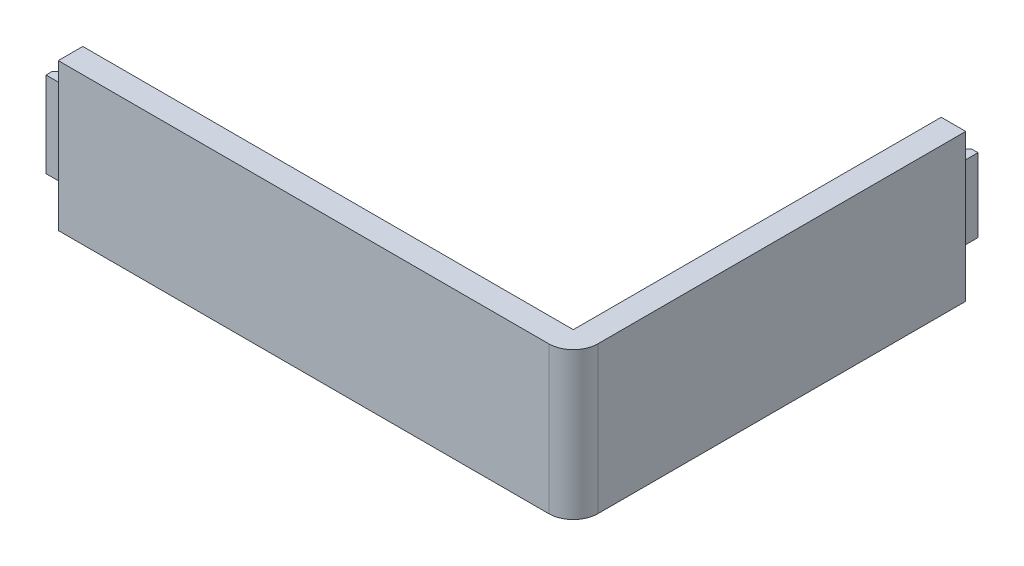
ISO-10303-21;
HEADER;
FILE_DESCRIPTION(('STEP AP214'),'2;1');
FILE_NAME('part.step','',(''),(''),'','','');
FILE_SCHEMA(('AUTOMOTIVE_DESIGN { 1 0 10303 214 1 1 1 1 }'));
ENDSEC;
DATA;
#1=APPLICATION_CONTEXT('core data for automotive mechanical design processes');
#2=APPLICATION_PROTOCOL_DEFINITION('international standard','automotive_design',2000,#1);
#3=PRODUCT_CONTEXT('',#1,'mechanical');
#4=PRODUCT('Part','Part','',(#3));
#5=PRODUCT_RELATED_PRODUCT_CATEGORY('part','',(#4));
#6=PRODUCT_DEFINITION_FORMATION('','',#4);
#7=PRODUCT_DEFINITION_CONTEXT('part definition',#1,'design');
#8=PRODUCT_DEFINITION('design','',#6,#7);
#9=PRODUCT_DEFINITION_SHAPE('','',#8);
#10=(LENGTH_UNIT() NAMED_UNIT(*) SI_UNIT(.MILLI.,.METRE.));
#11=(NAMED_UNIT(*) PLANE_ANGLE_UNIT() SI_UNIT($,.RADIAN.));
#12=(NAMED_UNIT(*) SI_UNIT($,.STERADIAN.) SOLID_ANGLE_UNIT());
#13=UNCERTAINTY_MEASURE_WITH_UNIT(LENGTH_MEASURE(1.E-05),#10,'distance_accuracy_value','');
#14=(GEOMETRIC_REPRESENTATION_CONTEXT(3) GLOBAL_UNCERTAINTY_ASSIGNED_CONTEXT((#13)) GLOBAL_UNIT_ASSIGNED_CONTEXT((#10,
#11,#12)) REPRESENTATION_CONTEXT('',''));
#15=CARTESIAN_POINT('',(0.,0.,0.));
#16=DIRECTION('',(0.,0.,1.));
#17=DIRECTION('',(1.,0.,0.));
#18=AXIS2_PLACEMENT_3D('',#15,#16,#17);
#19=CARTESIAN_POINT('',(105.,30.,-80.));
#20=DIRECTION('',(0.,0.,1.));
#21=DIRECTION('',(1.,0.,0.));
#22=AXIS2_PLACEMENT_3D('',#19,#20,#21);
#23=PLANE('',#22);
#24=DIRECTION('',(-1.,0.,0.));
#25=VECTOR('',#24,1.);
#26=CARTESIAN_POINT('',(100.,7.5,-80.));
#27=LINE('',#26,#25);
#28=CARTESIAN_POINT('',(102.5,7.5,-80.));
#29=VERTEX_POINT('',#28);
#30=CARTESIAN_POINT('',(100.,7.5,-80.));
#31=VERTEX_POINT('',#30);
#32=EDGE_CURVE('E167',#29,#31,#27,.T.);
#33=ORIENTED_EDGE('',*,*,#32,.F.);
#34=DIRECTION('',(0.,-1.,0.));
#35=VECTOR('',#34,1.);
#36=CARTESIAN_POINT('',(102.5,22.5,-80.));
#37=LINE('',#36,#35);
#38=CARTESIAN_POINT('',(102.5,22.5,-80.));
#39=VERTEX_POINT('',#38);
#40=EDGE_CURVE('E189',#39,#29,#37,.T.);
#41=ORIENTED_EDGE('',*,*,#40,.F.);
#42=DIRECTION('',(1.,0.,0.));
#43=VECTOR('',#42,1.);
#44=CARTESIAN_POINT('',(100.,22.5,-80.));
#45=LINE('',#44,#43);
#46=CARTESIAN_POINT('',(100.,22.5,-80.));
#47=VERTEX_POINT('',#46);
#48=EDGE_CURVE('E174',#47,#39,#45,.T.);
#49=ORIENTED_EDGE('',*,*,#48,.F.);
#50=DIRECTION('',(0.,-1.,0.));
#51=VECTOR('',#50,1.);
#52=CARTESIAN_POINT('',(100.,30.,-80.));
#53=LINE('',#52,#51);
#54=CARTESIAN_POINT('',(100.,30.,-80.));
#55=VERTEX_POINT('',#54);
#56=EDGE_CURVE('E258',#55,#47,#53,.T.);
#57=ORIENTED_EDGE('',*,*,#56,.F.);
#58=DIRECTION('',(-1.,0.,0.));
#59=VECTOR('',#58,1.);
#60=CARTESIAN_POINT('',(105.,30.,-80.));
#61=LINE('',#60,#59);
#62=CARTESIAN_POINT('',(105.,30.,-80.));
#63=VERTEX_POINT('',#62);
#64=EDGE_CURVE('E231',#63,#55,#61,.T.);
#65=ORIENTED_EDGE('',*,*,#64,.F.);
#66=DIRECTION('',(0.,-1.,0.));
#67=VECTOR('',#66,1.);
#68=CARTESIAN_POINT('',(105.,30.,-80.));
#69=LINE('',#68,#67);
#70=CARTESIAN_POINT('',(105.,0.,-80.));
#71=VERTEX_POINT('',#70);
#72=EDGE_CURVE('E261',#63,#71,#69,.T.);
#73=ORIENTED_EDGE('',*,*,#72,.T.);
#74=DIRECTION('',(-1.,0.,0.));
#75=VECTOR('',#74,1.);
#76=CARTESIAN_POINT('',(105.,0.,-80.));
#77=LINE('',#76,#75);
#78=CARTESIAN_POINT('',(100.,0.,-80.));
#79=VERTEX_POINT('',#78);
#80=EDGE_CURVE('E244',#71,#79,#77,.T.);
#81=ORIENTED_EDGE('',*,*,#80,.T.);
#82=EDGE_CURVE('E257',#31,#79,#53,.T.);
#83=ORIENTED_EDGE('',*,*,#82,.F.);
#84=EDGE_LOOP('',(#33,#41,#49,#57,#65,#73,#81,#83));
#85=FACE_BOUND('',#84,.T.);
#86=ADVANCED_FACE('F40',(#85),#23,.F.);
#87=CARTESIAN_POINT('',(0.,30.,0.));
#88=DIRECTION('',(1.,0.,0.));
#89=DIRECTION('',(0.,0.,-1.));
#90=AXIS2_PLACEMENT_3D('',#87,#88,#89);
#91=PLANE('',#90);
#92=DIRECTION('',(0.,0.,-1.));
#93=VECTOR('',#92,1.);
#94=CARTESIAN_POINT('',(0.,23.7123524039486,-5.));
#95=LINE('',#94,#93);
#96=CARTESIAN_POINT('',(0.,23.7123524039486,-2.5));
#97=VERTEX_POINT('',#96);
#98=CARTESIAN_POINT('',(0.,23.7123524039486,-5.));
#99=VERTEX_POINT('',#98);
#100=EDGE_CURVE('E200',#97,#99,#95,.T.);
#101=ORIENTED_EDGE('',*,*,#100,.F.);
#102=DIRECTION('',(0.,1.,0.));
#103=VECTOR('',#102,1.);
#104=CARTESIAN_POINT('',(0.,23.7123524039486,-2.5));
#105=LINE('',#104,#103);
#106=CARTESIAN_POINT('',(0.,6.28764759605142,-2.5));
#107=VERTEX_POINT('',#106);
#108=EDGE_CURVE('E208',#107,#97,#105,.T.);
#109=ORIENTED_EDGE('',*,*,#108,.F.);
#110=DIRECTION('',(0.,0.,1.));
#111=VECTOR('',#110,1.);
#112=CARTESIAN_POINT('',(0.,6.28764759605142,-5.));
#113=LINE('',#112,#111);
#114=CARTESIAN_POINT('',(0.,6.28764759605142,-5.));
#115=VERTEX_POINT('',#114);
#116=EDGE_CURVE('E196',#115,#107,#113,.T.);
#117=ORIENTED_EDGE('',*,*,#116,.F.);
#118=DIRECTION('',(0.,-1.,0.));
#119=VECTOR('',#118,1.);
#120=CARTESIAN_POINT('',(0.,30.,-5.));
#121=LINE('',#120,#119);
#122=CARTESIAN_POINT('',(0.,0.,-5.));
#123=VERTEX_POINT('',#122);
#124=EDGE_CURVE('E237',#115,#123,#121,.T.);
#125=ORIENTED_EDGE('',*,*,#124,.T.);
#126=DIRECTION('',(0.,0.,1.));
#127=VECTOR('',#126,1.);
#128=CARTESIAN_POINT('',(0.,0.,0.));
#129=LINE('',#128,#127);
#130=CARTESIAN_POINT('',(0.,0.,0.));
#131=VERTEX_POINT('',#130);
#132=EDGE_CURVE('E222',#123,#131,#129,.T.);
#133=ORIENTED_EDGE('',*,*,#132,.T.);
#134=DIRECTION('',(0.,-1.,0.));
#135=VECTOR('',#134,1.);
#136=CARTESIAN_POINT('',(0.,30.,0.));
#137=LINE('',#136,#135);
#138=CARTESIAN_POINT('',(0.,30.,0.));
#139=VERTEX_POINT('',#138);
#140=EDGE_CURVE('E264',#139,#131,#137,.T.);
#141=ORIENTED_EDGE('',*,*,#140,.F.);
#142=DIRECTION('',(0.,0.,1.));
#143=VECTOR('',#142,1.);
#144=CARTESIAN_POINT('',(0.,30.,0.));
#145=LINE('',#144,#143);
#146=CARTESIAN_POINT('',(0.,30.,-5.));
#147=VERTEX_POINT('',#146);
#148=EDGE_CURVE('E223',#147,#139,#145,.T.);
#149=ORIENTED_EDGE('',*,*,#148,.F.);
#150=EDGE_CURVE('E251',#147,#99,#121,.T.);
#151=ORIENTED_EDGE('',*,*,#150,.T.);
#152=EDGE_LOOP('',(#101,#109,#117,#125,#133,#141,#149,#151));
#153=FACE_BOUND('',#152,.T.);
#154=ADVANCED_FACE('F312',(#153),#91,.F.);
#155=CARTESIAN_POINT('',(0.,30.,0.));
#156=DIRECTION('',(0.,0.,-1.));
#157=DIRECTION('',(-1.,0.,0.));
#158=AXIS2_PLACEMENT_3D('',#155,#156,#157);
#159=PLANE('',#158);
#160=DIRECTION('',(1.,0.,0.));
#161=VECTOR('',#160,1.);
#162=CARTESIAN_POINT('',(0.,0.,0.));
#163=LINE('',#162,#161);
#164=CARTESIAN_POINT('',(100.,0.,0.));
#165=VERTEX_POINT('',#164);
#166=EDGE_CURVE('E240',#131,#165,#163,.T.);
#167=ORIENTED_EDGE('',*,*,#166,.T.);
#168=DIRECTION('',(0.,-1.,0.));
#169=VECTOR('',#168,1.);
#170=CARTESIAN_POINT('',(100.,30.,0.));
#171=LINE('',#170,#169);
#172=CARTESIAN_POINT('',(100.,30.,0.));
#173=VERTEX_POINT('',#172);
#174=EDGE_CURVE('E48',#165,#173,#171,.F.);
#175=ORIENTED_EDGE('',*,*,#174,.T.);
#176=DIRECTION('',(1.,0.,0.));
#177=VECTOR('',#176,1.);
#178=CARTESIAN_POINT('',(0.,30.,0.));
#179=LINE('',#178,#177);
#180=EDGE_CURVE('E226',#139,#173,#179,.T.);
#181=ORIENTED_EDGE('',*,*,#180,.F.);
#182=ORIENTED_EDGE('',*,*,#140,.T.);
#183=EDGE_LOOP('',(#167,#175,#181,#182));
#184=FACE_BOUND('',#183,.T.);
#185=ADVANCED_FACE('F317',(#184),#159,.F.);
#186=CARTESIAN_POINT('',(105.,30.,0.));
#187=DIRECTION('',(-1.,0.,0.));
#188=DIRECTION('',(0.,0.,1.));
#189=AXIS2_PLACEMENT_3D('',#186,#187,#188);
#190=PLANE('',#189);
#191=DIRECTION('',(0.,0.,-1.));
#192=VECTOR('',#191,1.);
#193=CARTESIAN_POINT('',(105.,30.,0.));
#194=LINE('',#193,#192);
#195=CARTESIAN_POINT('',(105.,30.,-5.));
#196=VERTEX_POINT('',#195);
#197=EDGE_CURVE('E229',#196,#63,#194,.T.);
#198=ORIENTED_EDGE('',*,*,#197,.F.);
#199=DIRECTION('',(0.,-1.,0.));
#200=VECTOR('',#199,1.);
#201=CARTESIAN_POINT('',(105.,30.,-5.));
#202=LINE('',#201,#200);
#203=CARTESIAN_POINT('',(105.,0.,-5.));
#204=VERTEX_POINT('',#203);
#205=EDGE_CURVE('E283',#196,#204,#202,.T.);
#206=ORIENTED_EDGE('',*,*,#205,.T.);
#207=DIRECTION('',(0.,0.,-1.));
#208=VECTOR('',#207,1.);
#209=CARTESIAN_POINT('',(105.,0.,0.));
#210=LINE('',#209,#208);
#211=EDGE_CURVE('E242',#204,#71,#210,.T.);
#212=ORIENTED_EDGE('',*,*,#211,.T.);
#213=ORIENTED_EDGE('',*,*,#72,.F.);
#214=EDGE_LOOP('',(#198,#206,#212,#213));
#215=FACE_BOUND('',#214,.T.);
#216=ADVANCED_FACE('F289',(#215),#190,.F.);
#217=CARTESIAN_POINT('',(100.,30.,-5.));
#218=DIRECTION('',(1.,0.,0.));
#219=DIRECTION('',(0.,0.,-1.));
#220=AXIS2_PLACEMENT_3D('',#217,#218,#219);
#221=PLANE('',#220);
#222=DIRECTION('',(0.,0.,1.));
#223=VECTOR('',#222,1.);
#224=CARTESIAN_POINT('',(100.,22.5,-85.));
#225=LINE('',#224,#223);
#226=CARTESIAN_POINT('',(100.,22.5,-83.75));
#227=VERTEX_POINT('',#226);
#228=EDGE_CURVE('E177',#227,#47,#225,.T.);
#229=ORIENTED_EDGE('',*,*,#228,.F.);
#230=DIRECTION('',(0.,-1.,0.));
#231=VECTOR('',#230,1.);
#232=CARTESIAN_POINT('',(100.,30.,-83.75));
#233=LINE('',#232,#231);
#234=CARTESIAN_POINT('',(100.,7.5,-83.75));
#235=VERTEX_POINT('',#234);
#236=EDGE_CURVE('E279',#227,#235,#233,.T.);
#237=ORIENTED_EDGE('',*,*,#236,.T.);
#238=DIRECTION('',(0.,0.,1.));
#239=VECTOR('',#238,1.);
#240=CARTESIAN_POINT('',(100.,7.5,-85.));
#241=LINE('',#240,#239);
#242=EDGE_CURVE('E185',#235,#31,#241,.T.);
#243=ORIENTED_EDGE('',*,*,#242,.T.);
#244=ORIENTED_EDGE('',*,*,#82,.T.);
#245=DIRECTION('',(0.,0.,1.));
#246=VECTOR('',#245,1.);
#247=CARTESIAN_POINT('',(100.,0.,-5.));
#248=LINE('',#247,#246);
#249=CARTESIAN_POINT('',(100.,0.,-5.));
#250=VERTEX_POINT('',#249);
#251=EDGE_CURVE('E247',#79,#250,#248,.T.);
#252=ORIENTED_EDGE('',*,*,#251,.T.);
#253=DIRECTION('',(0.,-1.,0.));
#254=VECTOR('',#253,1.);
#255=CARTESIAN_POINT('',(100.,30.,-5.));
#256=LINE('',#255,#254);
#257=CARTESIAN_POINT('',(100.,30.,-5.));
#258=VERTEX_POINT('',#257);
#259=EDGE_CURVE('E254',#258,#250,#256,.T.);
#260=ORIENTED_EDGE('',*,*,#259,.F.);
#261=DIRECTION('',(0.,0.,1.));
#262=VECTOR('',#261,1.);
#263=CARTESIAN_POINT('',(100.,30.,-5.));
#264=LINE('',#263,#262);
#265=EDGE_CURVE('E233',#55,#258,#264,.T.);
#266=ORIENTED_EDGE('',*,*,#265,.F.);
#267=ORIENTED_EDGE('',*,*,#56,.T.);
#268=EDGE_LOOP('',(#229,#237,#243,#244,#252,#260,#266,#267));
#269=FACE_BOUND('',#268,.T.);
#270=ADVANCED_FACE('F322',(#269),#221,.F.);
#271=CARTESIAN_POINT('',(0.,30.,-5.));
#272=DIRECTION('',(0.,0.,1.));
#273=DIRECTION('',(1.,0.,0.));
#274=AXIS2_PLACEMENT_3D('',#271,#272,#273);
#275=PLANE('',#274);
#276=DIRECTION('',(1.,0.,0.));
#277=VECTOR('',#276,1.);
#278=CARTESIAN_POINT('',(-5.,6.28764759605142,-5.));
#279=LINE('',#278,#277);
#280=CARTESIAN_POINT('',(-3.75,6.28764759605142,-5.));
#281=VERTEX_POINT('',#280);
#282=EDGE_CURVE('E220',#281,#115,#279,.T.);
#283=ORIENTED_EDGE('',*,*,#282,.F.);
#284=DIRECTION('',(0.,1.,0.));
#285=VECTOR('',#284,1.);
#286=CARTESIAN_POINT('',(-3.75,23.7123524039486,-5.));
#287=LINE('',#286,#285);
#288=CARTESIAN_POINT('',(-3.75,23.7123524039486,-5.));
#289=VERTEX_POINT('',#288);
#290=EDGE_CURVE('E272',#281,#289,#287,.T.);
#291=ORIENTED_EDGE('',*,*,#290,.T.);
#292=DIRECTION('',(1.,0.,0.));
#293=VECTOR('',#292,1.);
#294=CARTESIAN_POINT('',(-5.,23.7123524039486,-5.));
#295=LINE('',#294,#293);
#296=EDGE_CURVE('E205',#289,#99,#295,.T.);
#297=ORIENTED_EDGE('',*,*,#296,.T.);
#298=ORIENTED_EDGE('',*,*,#150,.F.);
#299=DIRECTION('',(-1.,0.,0.));
#300=VECTOR('',#299,1.);
#301=CARTESIAN_POINT('',(0.,30.,-5.));
#302=LINE('',#301,#300);
#303=EDGE_CURVE('E235',#258,#147,#302,.T.);
#304=ORIENTED_EDGE('',*,*,#303,.F.);
#305=ORIENTED_EDGE('',*,*,#259,.T.);
#306=DIRECTION('',(-1.,0.,0.));
#307=VECTOR('',#306,1.);
#308=CARTESIAN_POINT('',(0.,0.,-5.));
#309=LINE('',#308,#307);
#310=EDGE_CURVE('E227',#250,#123,#309,.T.);
#311=ORIENTED_EDGE('',*,*,#310,.T.);
#312=ORIENTED_EDGE('',*,*,#124,.F.);
#313=EDGE_LOOP('',(#283,#291,#297,#298,#304,#305,#311,#312));
#314=FACE_BOUND('',#313,.T.);
#315=ADVANCED_FACE('F365',(#314),#275,.F.);
#316=CARTESIAN_POINT('',(0.,30.,0.));
#317=DIRECTION('',(0.,-1.,0.));
#318=DIRECTION('',(0.,0.,-1.));
#319=AXIS2_PLACEMENT_3D('',#316,#317,#318);
#320=PLANE('',#319);
#321=ORIENTED_EDGE('',*,*,#180,.T.);
#322=CARTESIAN_POINT('',(100.,30.,-5.));
#323=DIRECTION('',(0.,-1.,0.));
#324=DIRECTION('',(0.,0.,-1.));
#325=AXIS2_PLACEMENT_3D('',#322,#323,#324);
#326=CIRCLE('',#325,5.);
#327=EDGE_CURVE('E11',#173,#196,#326,.F.);
#328=ORIENTED_EDGE('',*,*,#327,.T.);
#329=ORIENTED_EDGE('',*,*,#197,.T.);
#330=ORIENTED_EDGE('',*,*,#64,.T.);
#331=ORIENTED_EDGE('',*,*,#265,.T.);
#332=ORIENTED_EDGE('',*,*,#303,.T.);
#333=ORIENTED_EDGE('',*,*,#148,.T.);
#334=EDGE_LOOP('',(#321,#328,#329,#330,#331,#332,#333));
#335=FACE_BOUND('',#334,.T.);
#336=ADVANCED_FACE('F303',(#335),#320,.F.);
#337=CARTESIAN_POINT('',(0.,0.,0.));
#338=DIRECTION('',(0.,-1.,0.));
#339=DIRECTION('',(0.,0.,-1.));
#340=AXIS2_PLACEMENT_3D('',#337,#338,#339);
#341=PLANE('',#340);
#342=ORIENTED_EDGE('',*,*,#211,.F.);
#343=CARTESIAN_POINT('',(100.,0.,-5.));
#344=DIRECTION('',(0.,-1.,0.));
#345=DIRECTION('',(0.,0.,-1.));
#346=AXIS2_PLACEMENT_3D('',#343,#344,#345);
#347=CIRCLE('',#346,5.);
#348=EDGE_CURVE('E62',#204,#165,#347,.T.);
#349=ORIENTED_EDGE('',*,*,#348,.T.);
#350=ORIENTED_EDGE('',*,*,#166,.F.);
#351=ORIENTED_EDGE('',*,*,#132,.F.);
#352=ORIENTED_EDGE('',*,*,#310,.F.);
#353=ORIENTED_EDGE('',*,*,#251,.F.);
#354=ORIENTED_EDGE('',*,*,#80,.F.);
#355=EDGE_LOOP('',(#342,#349,#350,#351,#352,#353,#354));
#356=FACE_BOUND('',#355,.T.);
#357=ADVANCED_FACE('F294',(#356),#341,.T.);
#358=CARTESIAN_POINT('',(-5.,6.28764759605142,-5.));
#359=DIRECTION('',(0.,1.,0.));
#360=DIRECTION('',(0.,0.,1.));
#361=AXIS2_PLACEMENT_3D('',#358,#359,#360);
#362=PLANE('',#361);
#363=DIRECTION('',(0.,0.,1.));
#364=VECTOR('',#363,1.);
#365=CARTESIAN_POINT('',(-5.,6.28764759605142,-5.));
#366=LINE('',#365,#364);
#367=CARTESIAN_POINT('',(-5.,6.28764759605142,-3.74999999999998));
#368=VERTEX_POINT('',#367);
#369=CARTESIAN_POINT('',(-5.,6.28764759605142,-2.5));
#370=VERTEX_POINT('',#369);
#371=EDGE_CURVE('E197',#368,#370,#366,.T.);
#372=ORIENTED_EDGE('',*,*,#371,.F.);
#373=DIRECTION('',(0.707106781186544,0.,-0.707106781186551));
#374=VECTOR('',#373,1.);
#375=CARTESIAN_POINT('',(-5.,6.28764759605142,-3.74999999999998));
#376=LINE('',#375,#374);
#377=EDGE_CURVE('E270',#368,#281,#376,.T.);
#378=ORIENTED_EDGE('',*,*,#377,.T.);
#379=ORIENTED_EDGE('',*,*,#282,.T.);
#380=ORIENTED_EDGE('',*,*,#116,.T.);
#381=DIRECTION('',(1.,0.,0.));
#382=VECTOR('',#381,1.);
#383=CARTESIAN_POINT('',(-5.,6.28764759605142,-2.5));
#384=LINE('',#383,#382);
#385=EDGE_CURVE('E217',#370,#107,#384,.T.);
#386=ORIENTED_EDGE('',*,*,#385,.F.);
#387=EDGE_LOOP('',(#372,#378,#379,#380,#386));
#388=FACE_BOUND('',#387,.T.);
#389=ADVANCED_FACE('F368',(#388),#362,.F.);
#390=CARTESIAN_POINT('',(-5.,23.7123524039486,-2.5));
#391=DIRECTION('',(0.,0.,-1.));
#392=DIRECTION('',(0.,1.,0.));
#393=AXIS2_PLACEMENT_3D('',#390,#391,#392);
#394=PLANE('',#393);
#395=ORIENTED_EDGE('',*,*,#108,.T.);
#396=DIRECTION('',(1.,0.,0.));
#397=VECTOR('',#396,1.);
#398=CARTESIAN_POINT('',(-5.,23.7123524039486,-2.5));
#399=LINE('',#398,#397);
#400=CARTESIAN_POINT('',(-5.,23.7123524039486,-2.5));
#401=VERTEX_POINT('',#400);
#402=EDGE_CURVE('E214',#401,#97,#399,.T.);
#403=ORIENTED_EDGE('',*,*,#402,.F.);
#404=DIRECTION('',(0.,1.,0.));
#405=VECTOR('',#404,1.);
#406=CARTESIAN_POINT('',(-5.,23.7123524039486,-2.5));
#407=LINE('',#406,#405);
#408=EDGE_CURVE('E199',#370,#401,#407,.T.);
#409=ORIENTED_EDGE('',*,*,#408,.F.);
#410=ORIENTED_EDGE('',*,*,#385,.T.);
#411=EDGE_LOOP('',(#395,#403,#409,#410));
#412=FACE_BOUND('',#411,.T.);
#413=ADVANCED_FACE('F357',(#412),#394,.F.);
#414=CARTESIAN_POINT('',(-5.,23.7123524039486,-5.));
#415=DIRECTION('',(0.,-1.,0.));
#416=DIRECTION('',(0.,0.,-1.));
#417=AXIS2_PLACEMENT_3D('',#414,#415,#416);
#418=PLANE('',#417);
#419=ORIENTED_EDGE('',*,*,#296,.F.);
#420=DIRECTION('',(-0.707106781186544,0.,0.707106781186551));
#421=VECTOR('',#420,1.);
#422=CARTESIAN_POINT('',(-5.,23.7123524039486,-3.74999999999998));
#423=LINE('',#422,#421);
#424=CARTESIAN_POINT('',(-5.,23.7123524039486,-3.74999999999998));
#425=VERTEX_POINT('',#424);
#426=EDGE_CURVE('E274',#289,#425,#423,.T.);
#427=ORIENTED_EDGE('',*,*,#426,.T.);
#428=DIRECTION('',(0.,0.,-1.));
#429=VECTOR('',#428,1.);
#430=CARTESIAN_POINT('',(-5.,23.7123524039486,-5.));
#431=LINE('',#430,#429);
#432=EDGE_CURVE('E202',#401,#425,#431,.T.);
#433=ORIENTED_EDGE('',*,*,#432,.F.);
#434=ORIENTED_EDGE('',*,*,#402,.T.);
#435=ORIENTED_EDGE('',*,*,#100,.T.);
#436=EDGE_LOOP('',(#419,#427,#433,#434,#435));
#437=FACE_BOUND('',#436,.T.);
#438=ADVANCED_FACE('F343',(#437),#418,.F.);
#439=CARTESIAN_POINT('',(-5.,0.,0.));
#440=DIRECTION('',(-1.,0.,0.));
#441=DIRECTION('',(0.,0.,1.));
#442=AXIS2_PLACEMENT_3D('',#439,#440,#441);
#443=PLANE('',#442);
#444=ORIENTED_EDGE('',*,*,#432,.T.);
#445=DIRECTION('',(0.,-1.,0.));
#446=VECTOR('',#445,1.);
#447=CARTESIAN_POINT('',(-5.,6.28764759605142,-3.74999999999998));
#448=LINE('',#447,#446);
#449=EDGE_CURVE('E267',#425,#368,#448,.T.);
#450=ORIENTED_EDGE('',*,*,#449,.T.);
#451=ORIENTED_EDGE('',*,*,#371,.T.);
#452=ORIENTED_EDGE('',*,*,#408,.T.);
#453=EDGE_LOOP('',(#444,#450,#451,#452));
#454=FACE_BOUND('',#453,.T.);
#455=ADVANCED_FACE('F334',(#454),#443,.T.);
#456=CARTESIAN_POINT('',(-5.,0.,-3.74999999999998));
#457=DIRECTION('',(-0.707106781186551,0.,-0.707106781186543));
#458=DIRECTION('',(0.,1.,0.));
#459=AXIS2_PLACEMENT_3D('',#456,#457,#458);
#460=PLANE('',#459);
#461=ORIENTED_EDGE('',*,*,#426,.F.);
#462=ORIENTED_EDGE('',*,*,#290,.F.);
#463=ORIENTED_EDGE('',*,*,#377,.F.);
#464=ORIENTED_EDGE('',*,*,#449,.F.);
#465=EDGE_LOOP('',(#461,#462,#463,#464));
#466=FACE_BOUND('',#465,.T.);
#467=ADVANCED_FACE('F329',(#466),#460,.T.);
#468=CARTESIAN_POINT('',(100.,22.5,-85.));
#469=DIRECTION('',(0.,-1.,0.));
#470=DIRECTION('',(0.,0.,-1.));
#471=AXIS2_PLACEMENT_3D('',#468,#469,#470);
#472=PLANE('',#471);
#473=DIRECTION('',(1.,0.,0.));
#474=VECTOR('',#473,1.);
#475=CARTESIAN_POINT('',(100.,22.5,-85.));
#476=LINE('',#475,#474);
#477=CARTESIAN_POINT('',(101.25,22.5,-85.));
#478=VERTEX_POINT('',#477);
#479=CARTESIAN_POINT('',(102.5,22.5,-85.));
#480=VERTEX_POINT('',#479);
#481=EDGE_CURVE('E157',#478,#480,#476,.T.);
#482=ORIENTED_EDGE('',*,*,#481,.F.);
#483=DIRECTION('',(0.707106781186551,0.,-0.707106781186544));
#484=VECTOR('',#483,1.);
#485=CARTESIAN_POINT('',(101.25,22.5,-85.));
#486=LINE('',#485,#484);
#487=EDGE_CURVE('E277',#478,#227,#486,.F.);
#488=ORIENTED_EDGE('',*,*,#487,.T.);
#489=ORIENTED_EDGE('',*,*,#228,.T.);
#490=ORIENTED_EDGE('',*,*,#48,.T.);
#491=DIRECTION('',(0.,0.,1.));
#492=VECTOR('',#491,1.);
#493=CARTESIAN_POINT('',(102.5,22.5,-85.));
#494=LINE('',#493,#492);
#495=EDGE_CURVE('E171',#480,#39,#494,.T.);
#496=ORIENTED_EDGE('',*,*,#495,.F.);
#497=EDGE_LOOP('',(#482,#488,#489,#490,#496));
#498=FACE_BOUND('',#497,.T.);
#499=ADVANCED_FACE('F172',(#498),#472,.F.);
#500=CARTESIAN_POINT('',(102.5,22.5,-85.));
#501=DIRECTION('',(-1.,0.,0.));
#502=DIRECTION('',(0.,0.,1.));
#503=AXIS2_PLACEMENT_3D('',#500,#501,#502);
#504=PLANE('',#503);
#505=ORIENTED_EDGE('',*,*,#40,.T.);
#506=DIRECTION('',(0.,0.,1.));
#507=VECTOR('',#506,1.);
#508=CARTESIAN_POINT('',(102.5,7.5,-85.));
#509=LINE('',#508,#507);
#510=CARTESIAN_POINT('',(102.5,7.5,-85.));
#511=VERTEX_POINT('',#510);
#512=EDGE_CURVE('E178',#511,#29,#509,.T.);
#513=ORIENTED_EDGE('',*,*,#512,.F.);
#514=DIRECTION('',(0.,-1.,0.));
#515=VECTOR('',#514,1.);
#516=CARTESIAN_POINT('',(102.5,22.5,-85.));
#517=LINE('',#516,#515);
#518=EDGE_CURVE('E162',#480,#511,#517,.T.);
#519=ORIENTED_EDGE('',*,*,#518,.F.);
#520=ORIENTED_EDGE('',*,*,#495,.T.);
#521=EDGE_LOOP('',(#505,#513,#519,#520));
#522=FACE_BOUND('',#521,.T.);
#523=ADVANCED_FACE('F180',(#522),#504,.F.);
#524=CARTESIAN_POINT('',(100.,7.5,-85.));
#525=DIRECTION('',(0.,1.,0.));
#526=DIRECTION('',(-1.,0.,0.));
#527=AXIS2_PLACEMENT_3D('',#524,#525,#526);
#528=PLANE('',#527);
#529=ORIENTED_EDGE('',*,*,#242,.F.);
#530=DIRECTION('',(-0.707106781186551,0.,0.707106781186544));
#531=VECTOR('',#530,1.);
#532=CARTESIAN_POINT('',(101.25,7.5,-85.));
#533=LINE('',#532,#531);
#534=CARTESIAN_POINT('',(101.25,7.5,-85.));
#535=VERTEX_POINT('',#534);
#536=EDGE_CURVE('E281',#235,#535,#533,.F.);
#537=ORIENTED_EDGE('',*,*,#536,.T.);
#538=DIRECTION('',(-1.,0.,0.));
#539=VECTOR('',#538,1.);
#540=CARTESIAN_POINT('',(100.,7.5,-85.));
#541=LINE('',#540,#539);
#542=EDGE_CURVE('E183',#511,#535,#541,.T.);
#543=ORIENTED_EDGE('',*,*,#542,.F.);
#544=ORIENTED_EDGE('',*,*,#512,.T.);
#545=ORIENTED_EDGE('',*,*,#32,.T.);
#546=EDGE_LOOP('',(#529,#537,#543,#544,#545));
#547=FACE_BOUND('',#546,.T.);
#548=ADVANCED_FACE('F376',(#547),#528,.F.);
#549=CARTESIAN_POINT('',(0.,0.,-85.));
#550=DIRECTION('',(0.,0.,1.));
#551=DIRECTION('',(1.,0.,0.));
#552=AXIS2_PLACEMENT_3D('',#549,#550,#551);
#553=PLANE('',#552);
#554=ORIENTED_EDGE('',*,*,#542,.T.);
#555=DIRECTION('',(0.,1.,0.));
#556=VECTOR('',#555,1.);
#557=CARTESIAN_POINT('',(101.25,0.,-85.));
#558=LINE('',#557,#556);
#559=EDGE_CURVE('E165',#535,#478,#558,.T.);
#560=ORIENTED_EDGE('',*,*,#559,.T.);
#561=ORIENTED_EDGE('',*,*,#481,.T.);
#562=ORIENTED_EDGE('',*,*,#518,.T.);
#563=EDGE_LOOP('',(#554,#560,#561,#562));
#564=FACE_BOUND('',#563,.T.);
#565=ADVANCED_FACE('F160',(#564),#553,.F.);
#566=CARTESIAN_POINT('',(101.25,0.,-85.));
#567=DIRECTION('',(0.707106781186543,0.,0.707106781186551));
#568=DIRECTION('',(0.,1.,0.));
#569=AXIS2_PLACEMENT_3D('',#566,#567,#568);
#570=PLANE('',#569);
#571=ORIENTED_EDGE('',*,*,#536,.F.);
#572=ORIENTED_EDGE('',*,*,#236,.F.);
#573=ORIENTED_EDGE('',*,*,#487,.F.);
#574=ORIENTED_EDGE('',*,*,#559,.F.);
#575=EDGE_LOOP('',(#571,#572,#573,#574));
#576=FACE_BOUND('',#575,.T.);
#577=ADVANCED_FACE('F306',(#576),#570,.F.);
#578=CARTESIAN_POINT('',(100.,30.,-5.));
#579=DIRECTION('',(0.,-1.,0.));
#580=DIRECTION('',(0.,0.,-1.));
#581=AXIS2_PLACEMENT_3D('',#578,#579,#580);
#582=CYLINDRICAL_SURFACE('',#581,5.);
#583=ORIENTED_EDGE('',*,*,#327,.F.);
#584=ORIENTED_EDGE('',*,*,#174,.F.);
#585=ORIENTED_EDGE('',*,*,#348,.F.);
#586=ORIENTED_EDGE('',*,*,#205,.F.);
#587=EDGE_LOOP('',(#583,#584,#585,#586));
#588=FACE_BOUND('',#587,.T.);
#589=ADVANCED_FACE('F42',(#588),#582,.T.);
#590=CLOSED_SHELL('',(#86,#154,#185,#216,#270,#315,#336,#357,#389,#413,#438,#455,#467,#499,#523,
#548,#565,#577,#589));
#591=MANIFOLD_SOLID_BREP('B2',#590);
#592=ADVANCED_BREP_SHAPE_REPRESENTATION('',(#18,#591),#14);
#593=SHAPE_DEFINITION_REPRESENTATION(#9,#592);
ENDSEC;
END-ISO-10303-21;
